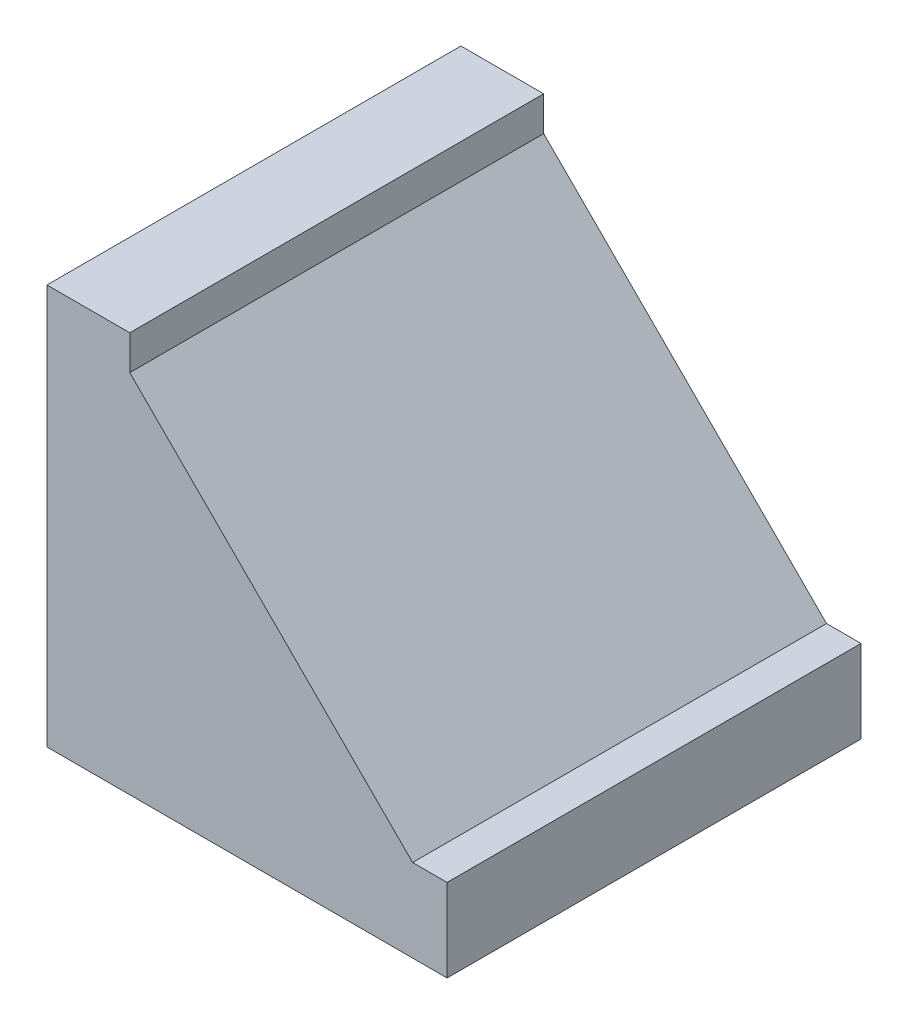
ISO-10303-21;
HEADER;
FILE_DESCRIPTION(('STEP AP214'),'2;1');
FILE_NAME('part.step','',(''),(''),'','','');
FILE_SCHEMA(('AUTOMOTIVE_DESIGN { 1 0 10303 214 1 1 1 1 }'));
ENDSEC;
DATA;
#1=APPLICATION_CONTEXT('core data for automotive mechanical design processes');
#2=APPLICATION_PROTOCOL_DEFINITION('international standard','automotive_design',2000,#1);
#3=PRODUCT_CONTEXT('',#1,'mechanical');
#4=PRODUCT('Part','Part','',(#3));
#5=PRODUCT_RELATED_PRODUCT_CATEGORY('part','',(#4));
#6=PRODUCT_DEFINITION_FORMATION('','',#4);
#7=PRODUCT_DEFINITION_CONTEXT('part definition',#1,'design');
#8=PRODUCT_DEFINITION('design','',#6,#7);
#9=PRODUCT_DEFINITION_SHAPE('','',#8);
#10=(LENGTH_UNIT() NAMED_UNIT(*) SI_UNIT(.MILLI.,.METRE.));
#11=(NAMED_UNIT(*) PLANE_ANGLE_UNIT() SI_UNIT($,.RADIAN.));
#12=(NAMED_UNIT(*) SI_UNIT($,.STERADIAN.) SOLID_ANGLE_UNIT());
#13=UNCERTAINTY_MEASURE_WITH_UNIT(LENGTH_MEASURE(1.E-05),#10,'distance_accuracy_value','');
#14=(GEOMETRIC_REPRESENTATION_CONTEXT(3) GLOBAL_UNCERTAINTY_ASSIGNED_CONTEXT((#13)) GLOBAL_UNIT_ASSIGNED_CONTEXT((#10,
#11,#12)) REPRESENTATION_CONTEXT('',''));
#15=CARTESIAN_POINT('',(0.,0.,0.));
#16=DIRECTION('',(0.,0.,1.));
#17=DIRECTION('',(1.,0.,0.));
#18=AXIS2_PLACEMENT_3D('',#15,#16,#17);
#19=CARTESIAN_POINT('',(12.,58.,60.));
#20=DIRECTION('',(0.,-1.,0.));
#21=DIRECTION('',(1.,0.,0.));
#22=AXIS2_PLACEMENT_3D('',#19,#20,#21);
#23=PLANE('',#22);
#24=DIRECTION('',(-1.,0.,0.));
#25=VECTOR('',#24,1.);
#26=CARTESIAN_POINT('',(12.,58.,0.));
#27=LINE('',#26,#25);
#28=CARTESIAN_POINT('',(12.,58.,0.));
#29=VERTEX_POINT('',#28);
#30=CARTESIAN_POINT('',(0.,58.,0.));
#31=VERTEX_POINT('',#30);
#32=EDGE_CURVE('E124',#29,#31,#27,.T.);
#33=ORIENTED_EDGE('',*,*,#32,.T.);
#34=DIRECTION('',(0.,0.,-1.));
#35=VECTOR('',#34,1.);
#36=CARTESIAN_POINT('',(0.,58.,60.));
#37=LINE('',#36,#35);
#38=CARTESIAN_POINT('',(0.,58.,60.));
#39=VERTEX_POINT('',#38);
#40=EDGE_CURVE('E11',#39,#31,#37,.T.);
#41=ORIENTED_EDGE('',*,*,#40,.F.);
#42=DIRECTION('',(-1.,0.,0.));
#43=VECTOR('',#42,1.);
#44=CARTESIAN_POINT('',(12.,58.,60.));
#45=LINE('',#44,#43);
#46=CARTESIAN_POINT('',(12.,58.,60.));
#47=VERTEX_POINT('',#46);
#48=EDGE_CURVE('E136',#47,#39,#45,.T.);
#49=ORIENTED_EDGE('',*,*,#48,.F.);
#50=DIRECTION('',(0.,0.,-1.));
#51=VECTOR('',#50,1.);
#52=CARTESIAN_POINT('',(12.,58.,60.));
#53=LINE('',#52,#51);
#54=EDGE_CURVE('E120',#47,#29,#53,.T.);
#55=ORIENTED_EDGE('',*,*,#54,.T.);
#56=EDGE_LOOP('',(#33,#41,#49,#55));
#57=FACE_BOUND('',#56,.T.);
#58=ADVANCED_FACE('F34',(#57),#23,.F.);
#59=CARTESIAN_POINT('',(0.,58.,60.));
#60=DIRECTION('',(1.,0.,0.));
#61=DIRECTION('',(0.,1.,0.));
#62=AXIS2_PLACEMENT_3D('',#59,#60,#61);
#63=PLANE('',#62);
#64=DIRECTION('',(0.,-1.,0.));
#65=VECTOR('',#64,1.);
#66=CARTESIAN_POINT('',(0.,58.,0.));
#67=LINE('',#66,#65);
#68=CARTESIAN_POINT('',(0.,0.,0.));
#69=VERTEX_POINT('',#68);
#70=EDGE_CURVE('E127',#31,#69,#67,.T.);
#71=ORIENTED_EDGE('',*,*,#70,.T.);
#72=DIRECTION('',(0.,0.,-1.));
#73=VECTOR('',#72,1.);
#74=CARTESIAN_POINT('',(0.,0.,60.));
#75=LINE('',#74,#73);
#76=CARTESIAN_POINT('',(0.,0.,60.));
#77=VERTEX_POINT('',#76);
#78=EDGE_CURVE('E42',#77,#69,#75,.T.);
#79=ORIENTED_EDGE('',*,*,#78,.F.);
#80=DIRECTION('',(0.,-1.,0.));
#81=VECTOR('',#80,1.);
#82=CARTESIAN_POINT('',(0.,58.,60.));
#83=LINE('',#82,#81);
#84=EDGE_CURVE('E90',#39,#77,#83,.T.);
#85=ORIENTED_EDGE('',*,*,#84,.F.);
#86=ORIENTED_EDGE('',*,*,#40,.T.);
#87=EDGE_LOOP('',(#71,#79,#85,#86));
#88=FACE_BOUND('',#87,.T.);
#89=ADVANCED_FACE('F161',(#88),#63,.F.);
#90=CARTESIAN_POINT('',(0.,0.,60.));
#91=DIRECTION('',(0.,1.,0.));
#92=DIRECTION('',(0.,0.,1.));
#93=AXIS2_PLACEMENT_3D('',#90,#91,#92);
#94=PLANE('',#93);
#95=DIRECTION('',(1.,0.,0.));
#96=VECTOR('',#95,1.);
#97=CARTESIAN_POINT('',(0.,0.,0.));
#98=LINE('',#97,#96);
#99=CARTESIAN_POINT('',(58.,0.,0.));
#100=VERTEX_POINT('',#99);
#101=EDGE_CURVE('E129',#69,#100,#98,.T.);
#102=ORIENTED_EDGE('',*,*,#101,.T.);
#103=DIRECTION('',(0.,0.,-1.));
#104=VECTOR('',#103,1.);
#105=CARTESIAN_POINT('',(58.,0.,60.));
#106=LINE('',#105,#104);
#107=CARTESIAN_POINT('',(58.,0.,60.));
#108=VERTEX_POINT('',#107);
#109=EDGE_CURVE('E140',#108,#100,#106,.T.);
#110=ORIENTED_EDGE('',*,*,#109,.F.);
#111=DIRECTION('',(1.,0.,0.));
#112=VECTOR('',#111,1.);
#113=CARTESIAN_POINT('',(0.,0.,60.));
#114=LINE('',#113,#112);
#115=EDGE_CURVE('E148',#77,#108,#114,.T.);
#116=ORIENTED_EDGE('',*,*,#115,.F.);
#117=ORIENTED_EDGE('',*,*,#78,.T.);
#118=EDGE_LOOP('',(#102,#110,#116,#117));
#119=FACE_BOUND('',#118,.T.);
#120=ADVANCED_FACE('F146',(#119),#94,.F.);
#121=CARTESIAN_POINT('',(58.,0.,60.));
#122=DIRECTION('',(-1.,0.,0.));
#123=DIRECTION('',(0.,-1.,0.));
#124=AXIS2_PLACEMENT_3D('',#121,#122,#123);
#125=PLANE('',#124);
#126=DIRECTION('',(0.,1.,0.));
#127=VECTOR('',#126,1.);
#128=CARTESIAN_POINT('',(58.,0.,0.));
#129=LINE('',#128,#127);
#130=CARTESIAN_POINT('',(58.,12.,0.));
#131=VERTEX_POINT('',#130);
#132=EDGE_CURVE('E131',#100,#131,#129,.T.);
#133=ORIENTED_EDGE('',*,*,#132,.T.);
#134=DIRECTION('',(0.,0.,-1.));
#135=VECTOR('',#134,1.);
#136=CARTESIAN_POINT('',(58.,12.,60.));
#137=LINE('',#136,#135);
#138=CARTESIAN_POINT('',(58.,12.,60.));
#139=VERTEX_POINT('',#138);
#140=EDGE_CURVE('E115',#139,#131,#137,.T.);
#141=ORIENTED_EDGE('',*,*,#140,.F.);
#142=DIRECTION('',(0.,1.,0.));
#143=VECTOR('',#142,1.);
#144=CARTESIAN_POINT('',(58.,0.,60.));
#145=LINE('',#144,#143);
#146=EDGE_CURVE('E106',#108,#139,#145,.T.);
#147=ORIENTED_EDGE('',*,*,#146,.F.);
#148=ORIENTED_EDGE('',*,*,#109,.T.);
#149=EDGE_LOOP('',(#133,#141,#147,#148));
#150=FACE_BOUND('',#149,.T.);
#151=ADVANCED_FACE('F154',(#150),#125,.F.);
#152=CARTESIAN_POINT('',(58.,12.,60.));
#153=DIRECTION('',(0.,-1.,0.));
#154=DIRECTION('',(1.,0.,0.));
#155=AXIS2_PLACEMENT_3D('',#152,#153,#154);
#156=PLANE('',#155);
#157=DIRECTION('',(-1.,0.,0.));
#158=VECTOR('',#157,1.);
#159=CARTESIAN_POINT('',(58.,12.,0.));
#160=LINE('',#159,#158);
#161=CARTESIAN_POINT('',(53.,12.,0.));
#162=VERTEX_POINT('',#161);
#163=EDGE_CURVE('E114',#131,#162,#160,.T.);
#164=ORIENTED_EDGE('',*,*,#163,.T.);
#165=DIRECTION('',(0.,0.,-1.));
#166=VECTOR('',#165,1.);
#167=CARTESIAN_POINT('',(53.,12.,60.));
#168=LINE('',#167,#166);
#169=CARTESIAN_POINT('',(53.,12.,60.));
#170=VERTEX_POINT('',#169);
#171=EDGE_CURVE('E111',#170,#162,#168,.T.);
#172=ORIENTED_EDGE('',*,*,#171,.F.);
#173=DIRECTION('',(-1.,0.,0.));
#174=VECTOR('',#173,1.);
#175=CARTESIAN_POINT('',(58.,12.,60.));
#176=LINE('',#175,#174);
#177=EDGE_CURVE('E100',#139,#170,#176,.T.);
#178=ORIENTED_EDGE('',*,*,#177,.F.);
#179=ORIENTED_EDGE('',*,*,#140,.T.);
#180=EDGE_LOOP('',(#164,#172,#178,#179));
#181=FACE_BOUND('',#180,.T.);
#182=ADVANCED_FACE('F112',(#181),#156,.F.);
#183=CARTESIAN_POINT('',(53.,12.,60.));
#184=DIRECTION('',(-0.707106781186548,-0.707106781186547,0.));
#185=DIRECTION('',(0.707106781186547,-0.707106781186548,0.));
#186=AXIS2_PLACEMENT_3D('',#183,#184,#185);
#187=PLANE('',#186);
#188=DIRECTION('',(-0.707106781186547,0.707106781186548,0.));
#189=VECTOR('',#188,1.);
#190=CARTESIAN_POINT('',(53.,12.,0.));
#191=LINE('',#190,#189);
#192=CARTESIAN_POINT('',(12.,53.,0.));
#193=VERTEX_POINT('',#192);
#194=EDGE_CURVE('E76',#162,#193,#191,.T.);
#195=ORIENTED_EDGE('',*,*,#194,.T.);
#196=DIRECTION('',(0.,0.,-1.));
#197=VECTOR('',#196,1.);
#198=CARTESIAN_POINT('',(12.,53.,60.));
#199=LINE('',#198,#197);
#200=CARTESIAN_POINT('',(12.,53.,60.));
#201=VERTEX_POINT('',#200);
#202=EDGE_CURVE('E116',#201,#193,#199,.T.);
#203=ORIENTED_EDGE('',*,*,#202,.F.);
#204=DIRECTION('',(-0.707106781186547,0.707106781186548,0.));
#205=VECTOR('',#204,1.);
#206=CARTESIAN_POINT('',(53.,12.,60.));
#207=LINE('',#206,#205);
#208=EDGE_CURVE('E104',#170,#201,#207,.T.);
#209=ORIENTED_EDGE('',*,*,#208,.F.);
#210=ORIENTED_EDGE('',*,*,#171,.T.);
#211=EDGE_LOOP('',(#195,#203,#209,#210));
#212=FACE_BOUND('',#211,.T.);
#213=ADVANCED_FACE('F118',(#212),#187,.F.);
#214=CARTESIAN_POINT('',(12.,53.,60.));
#215=DIRECTION('',(-1.,0.,0.));
#216=DIRECTION('',(0.,-1.,0.));
#217=AXIS2_PLACEMENT_3D('',#214,#215,#216);
#218=PLANE('',#217);
#219=DIRECTION('',(0.,1.,0.));
#220=VECTOR('',#219,1.);
#221=CARTESIAN_POINT('',(12.,53.,0.));
#222=LINE('',#221,#220);
#223=EDGE_CURVE('E82',#193,#29,#222,.T.);
#224=ORIENTED_EDGE('',*,*,#223,.T.);
#225=ORIENTED_EDGE('',*,*,#54,.F.);
#226=DIRECTION('',(0.,1.,0.));
#227=VECTOR('',#226,1.);
#228=CARTESIAN_POINT('',(12.,53.,60.));
#229=LINE('',#228,#227);
#230=EDGE_CURVE('E50',#201,#47,#229,.T.);
#231=ORIENTED_EDGE('',*,*,#230,.F.);
#232=ORIENTED_EDGE('',*,*,#202,.T.);
#233=EDGE_LOOP('',(#224,#225,#231,#232));
#234=FACE_BOUND('',#233,.T.);
#235=ADVANCED_FACE('F175',(#234),#218,.F.);
#236=CARTESIAN_POINT('',(0.,0.,60.));
#237=DIRECTION('',(0.,0.,1.));
#238=DIRECTION('',(1.,0.,0.));
#239=AXIS2_PLACEMENT_3D('',#236,#237,#238);
#240=PLANE('',#239);
#241=ORIENTED_EDGE('',*,*,#48,.T.);
#242=ORIENTED_EDGE('',*,*,#84,.T.);
#243=ORIENTED_EDGE('',*,*,#115,.T.);
#244=ORIENTED_EDGE('',*,*,#146,.T.);
#245=ORIENTED_EDGE('',*,*,#177,.T.);
#246=ORIENTED_EDGE('',*,*,#208,.T.);
#247=ORIENTED_EDGE('',*,*,#230,.T.);
#248=EDGE_LOOP('',(#241,#242,#243,#244,#245,#246,#247));
#249=FACE_BOUND('',#248,.T.);
#250=ADVANCED_FACE('F102',(#249),#240,.T.);
#251=CARTESIAN_POINT('',(0.,0.,0.));
#252=DIRECTION('',(0.,0.,1.));
#253=DIRECTION('',(1.,0.,0.));
#254=AXIS2_PLACEMENT_3D('',#251,#252,#253);
#255=PLANE('',#254);
#256=ORIENTED_EDGE('',*,*,#32,.F.);
#257=ORIENTED_EDGE('',*,*,#223,.F.);
#258=ORIENTED_EDGE('',*,*,#194,.F.);
#259=ORIENTED_EDGE('',*,*,#163,.F.);
#260=ORIENTED_EDGE('',*,*,#132,.F.);
#261=ORIENTED_EDGE('',*,*,#101,.F.);
#262=ORIENTED_EDGE('',*,*,#70,.F.);
#263=EDGE_LOOP('',(#256,#257,#258,#259,#260,#261,#262));
#264=FACE_BOUND('',#263,.T.);
#265=ADVANCED_FACE('F152',(#264),#255,.F.);
#266=CLOSED_SHELL('',(#58,#89,#120,#151,#182,#213,#235,#250,#265));
#267=MANIFOLD_SOLID_BREP('B2',#266);
#268=ADVANCED_BREP_SHAPE_REPRESENTATION('',(#18,#267),#14);
#269=SHAPE_DEFINITION_REPRESENTATION(#9,#268);
ENDSEC;
END-ISO-10303-21;
